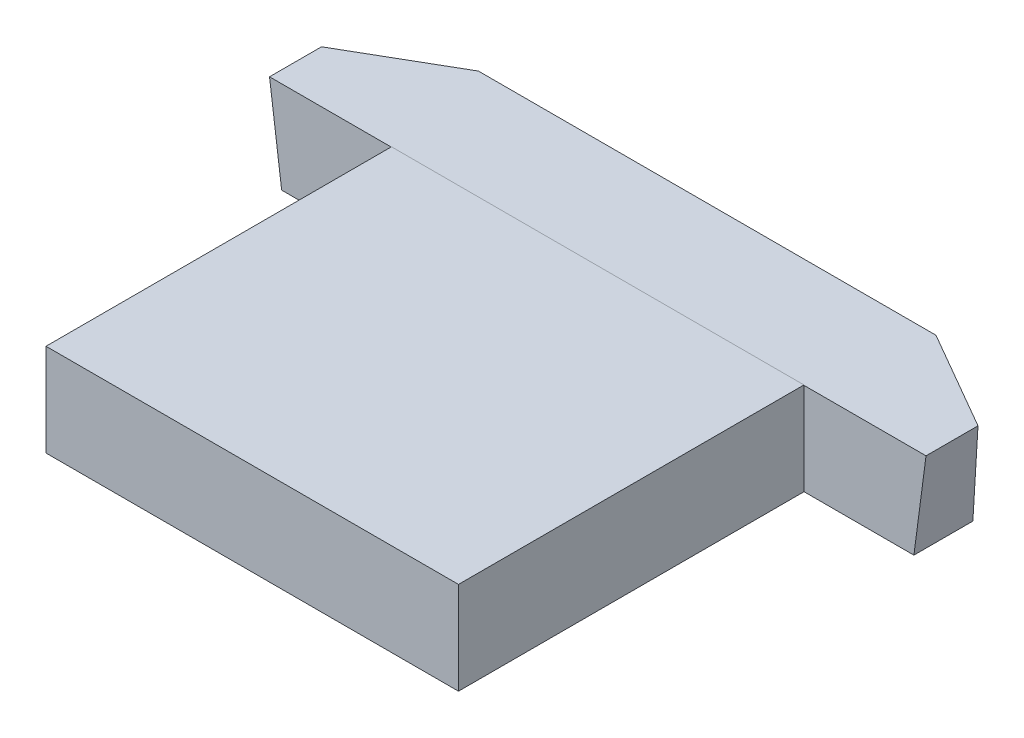
ISO-10303-21;
HEADER;
FILE_DESCRIPTION(('STEP AP214'),'2;1');
FILE_NAME('part.step','',(''),(''),'','','');
FILE_SCHEMA(('AUTOMOTIVE_DESIGN { 1 0 10303 214 1 1 1 1 }'));
ENDSEC;
DATA;
#1=APPLICATION_CONTEXT('core data for automotive mechanical design processes');
#2=APPLICATION_PROTOCOL_DEFINITION('international standard','automotive_design',2000,#1);
#3=PRODUCT_CONTEXT('',#1,'mechanical');
#4=PRODUCT('Part','Part','',(#3));
#5=PRODUCT_RELATED_PRODUCT_CATEGORY('part','',(#4));
#6=PRODUCT_DEFINITION_FORMATION('','',#4);
#7=PRODUCT_DEFINITION_CONTEXT('part definition',#1,'design');
#8=PRODUCT_DEFINITION('design','',#6,#7);
#9=PRODUCT_DEFINITION_SHAPE('','',#8);
#10=(LENGTH_UNIT() NAMED_UNIT(*) SI_UNIT(.MILLI.,.METRE.));
#11=(NAMED_UNIT(*) PLANE_ANGLE_UNIT() SI_UNIT($,.RADIAN.));
#12=(NAMED_UNIT(*) SI_UNIT($,.STERADIAN.) SOLID_ANGLE_UNIT());
#13=UNCERTAINTY_MEASURE_WITH_UNIT(LENGTH_MEASURE(1.E-05),#10,'distance_accuracy_value','');
#14=(GEOMETRIC_REPRESENTATION_CONTEXT(3) GLOBAL_UNCERTAINTY_ASSIGNED_CONTEXT((#13)) GLOBAL_UNIT_ASSIGNED_CONTEXT((#10,
#11,#12)) REPRESENTATION_CONTEXT('',''));
#15=CARTESIAN_POINT('',(0.,0.,0.));
#16=DIRECTION('',(0.,0.,1.));
#17=DIRECTION('',(1.,0.,0.));
#18=AXIS2_PLACEMENT_3D('',#15,#16,#17);
#19=CARTESIAN_POINT('',(3.11,-2.3789,0.5725));
#20=DIRECTION('',(1.,0.,0.));
#21=DIRECTION('',(0.,0.,-1.));
#22=AXIS2_PLACEMENT_3D('',#19,#20,#21);
#23=PLANE('',#22);
#24=DIRECTION('',(0.,0.99144486137382,0.130526192219976));
#25=VECTOR('',#24,1.);
#26=CARTESIAN_POINT('',(3.11,-0.84048504976,-4.618151955986));
#27=LINE('',#26,#25);
#28=CARTESIAN_POINT('',(3.11,-0.99,-4.637835972612));
#29=VERTEX_POINT('',#28);
#30=CARTESIAN_POINT('',(3.11,-0.9839,-4.637032892376));
#31=VERTEX_POINT('',#30);
#32=EDGE_CURVE('E11',#29,#31,#27,.T.);
#33=ORIENTED_EDGE('',*,*,#32,.T.);
#34=DIRECTION('',(0.,0.,-1.));
#35=VECTOR('',#34,1.);
#36=CARTESIAN_POINT('',(3.11,-0.9839,-6.2875));
#37=LINE('',#36,#35);
#38=CARTESIAN_POINT('',(3.11,-0.9839,0.5725));
#39=VERTEX_POINT('',#38);
#40=EDGE_CURVE('E41',#39,#31,#37,.T.);
#41=ORIENTED_EDGE('',*,*,#40,.F.);
#42=DIRECTION('',(0.,1.,0.));
#43=VECTOR('',#42,1.);
#44=CARTESIAN_POINT('',(3.11,-2.3789,0.5725));
#45=LINE('',#44,#43);
#46=CARTESIAN_POINT('',(3.11,-2.3789,0.5725));
#47=VERTEX_POINT('',#46);
#48=EDGE_CURVE('E172',#47,#39,#45,.T.);
#49=ORIENTED_EDGE('',*,*,#48,.F.);
#50=DIRECTION('',(0.,0.,-1.));
#51=VECTOR('',#50,1.);
#52=CARTESIAN_POINT('',(3.11,-2.3789,0.408880478544));
#53=LINE('',#52,#51);
#54=CARTESIAN_POINT('',(3.11,-2.3789,-4.637835972612));
#55=VERTEX_POINT('',#54);
#56=EDGE_CURVE('E27',#47,#55,#53,.T.);
#57=ORIENTED_EDGE('',*,*,#56,.T.);
#58=DIRECTION('',(0.,1.,0.));
#59=VECTOR('',#58,1.);
#60=CARTESIAN_POINT('',(3.11,-2.3789,-4.637835972612));
#61=LINE('',#60,#59);
#62=EDGE_CURVE('E245',#55,#29,#61,.T.);
#63=ORIENTED_EDGE('',*,*,#62,.T.);
#64=EDGE_LOOP('',(#33,#41,#49,#57,#63));
#65=FACE_BOUND('',#64,.T.);
#66=ADVANCED_FACE('F17',(#65),#23,.T.);
#67=CARTESIAN_POINT('',(1.779166753583,-0.9839,-6.562863377694));
#68=DIRECTION('',(0.,1.,0.));
#69=DIRECTION('',(1.,0.,0.));
#70=AXIS2_PLACEMENT_3D('',#67,#68,#69);
#71=PLANE('',#70);
#72=DIRECTION('',(-1.,0.,0.));
#73=VECTOR('',#72,1.);
#74=CARTESIAN_POINT('',(-1.650416623208,-0.9839,-4.637032892376));
#75=LINE('',#74,#73);
#76=CARTESIAN_POINT('',(-3.11,-0.9839,-4.637032892376));
#77=VERTEX_POINT('',#76);
#78=EDGE_CURVE('E248',#31,#77,#75,.T.);
#79=ORIENTED_EDGE('',*,*,#78,.T.);
#80=DIRECTION('',(0.,0.,1.));
#81=VECTOR('',#80,1.);
#82=CARTESIAN_POINT('',(-3.11,-0.9839,0.5725));
#83=LINE('',#82,#81);
#84=CARTESIAN_POINT('',(-3.11,-0.9839,0.5725));
#85=VERTEX_POINT('',#84);
#86=EDGE_CURVE('E20',#77,#85,#83,.T.);
#87=ORIENTED_EDGE('',*,*,#86,.T.);
#88=DIRECTION('',(1.,0.,0.));
#89=VECTOR('',#88,1.);
#90=CARTESIAN_POINT('',(3.11,-0.9839,0.5725));
#91=LINE('',#90,#89);
#92=EDGE_CURVE('E260',#85,#39,#91,.T.);
#93=ORIENTED_EDGE('',*,*,#92,.T.);
#94=ORIENTED_EDGE('',*,*,#40,.T.);
#95=EDGE_LOOP('',(#79,#87,#93,#94));
#96=FACE_BOUND('',#95,.T.);
#97=ADVANCED_FACE('F300',(#96),#71,.T.);
#98=CARTESIAN_POINT('',(-3.11,-2.3789,-6.2875));
#99=DIRECTION('',(-1.,0.,0.));
#100=DIRECTION('',(0.,1.,0.));
#101=AXIS2_PLACEMENT_3D('',#98,#99,#100);
#102=PLANE('',#101);
#103=DIRECTION('',(0.,-0.99144486137382,-0.130526192219976));
#104=VECTOR('',#103,1.);
#105=CARTESIAN_POINT('',(-3.11,-1.28435971211,-4.6765891639));
#106=LINE('',#105,#104);
#107=CARTESIAN_POINT('',(-3.11,-0.99,-4.637835972612));
#108=VERTEX_POINT('',#107);
#109=EDGE_CURVE('E196',#77,#108,#106,.T.);
#110=ORIENTED_EDGE('',*,*,#109,.T.);
#111=DIRECTION('',(0.,-1.,0.));
#112=VECTOR('',#111,1.);
#113=CARTESIAN_POINT('',(-3.11,-2.3789,-4.637835972612));
#114=LINE('',#113,#112);
#115=CARTESIAN_POINT('',(-3.11,-2.3789,-4.637835972612));
#116=VERTEX_POINT('',#115);
#117=EDGE_CURVE('E192',#108,#116,#114,.T.);
#118=ORIENTED_EDGE('',*,*,#117,.T.);
#119=DIRECTION('',(0.,0.,1.));
#120=VECTOR('',#119,1.);
#121=CARTESIAN_POINT('',(-3.11,-2.3789,-3.021119521456));
#122=LINE('',#121,#120);
#123=CARTESIAN_POINT('',(-3.11,-2.3789,0.5725));
#124=VERTEX_POINT('',#123);
#125=EDGE_CURVE('E197',#116,#124,#122,.T.);
#126=ORIENTED_EDGE('',*,*,#125,.T.);
#127=DIRECTION('',(0.,1.,0.));
#128=VECTOR('',#127,1.);
#129=CARTESIAN_POINT('',(-3.11,-2.3789,0.5725));
#130=LINE('',#129,#128);
#131=EDGE_CURVE('E201',#124,#85,#130,.T.);
#132=ORIENTED_EDGE('',*,*,#131,.T.);
#133=ORIENTED_EDGE('',*,*,#86,.F.);
#134=EDGE_LOOP('',(#110,#118,#126,#132,#133));
#135=FACE_BOUND('',#134,.T.);
#136=ADVANCED_FACE('F278',(#135),#102,.T.);
#137=CARTESIAN_POINT('',(-4.949664027388,-2.3789,-4.637835972612));
#138=DIRECTION('',(0.,0.,1.));
#139=DIRECTION('',(1.,0.,0.));
#140=AXIS2_PLACEMENT_3D('',#137,#138,#139);
#141=PLANE('',#140);
#142=DIRECTION('',(-1.,0.,0.));
#143=VECTOR('',#142,1.);
#144=CARTESIAN_POINT('',(7.837924348314,-0.99,-4.637835972612));
#145=LINE('',#144,#143);
#146=CARTESIAN_POINT('',(-4.949664027388,-0.99,-4.637835972612));
#147=VERTEX_POINT('',#146);
#148=EDGE_CURVE('E198',#108,#147,#145,.T.);
#149=ORIENTED_EDGE('',*,*,#148,.T.);
#150=DIRECTION('',(0.130526192219976,-0.99144486137382,0.));
#151=VECTOR('',#150,1.);
#152=CARTESIAN_POINT('',(-4.924963570759,-1.177618595033,-4.637835972612));
#153=LINE('',#152,#151);
#154=CARTESIAN_POINT('',(-4.766811873489,-2.3789,-4.637835972612));
#155=VERTEX_POINT('',#154);
#156=EDGE_CURVE('E202',#147,#155,#153,.T.);
#157=ORIENTED_EDGE('',*,*,#156,.T.);
#158=DIRECTION('',(1.,0.,0.));
#159=VECTOR('',#158,1.);
#160=CARTESIAN_POINT('',(-2.000660842792,-2.3789,-4.637835972612));
#161=LINE('',#160,#159);
#162=EDGE_CURVE('E116',#155,#116,#161,.T.);
#163=ORIENTED_EDGE('',*,*,#162,.T.);
#164=ORIENTED_EDGE('',*,*,#117,.F.);
#165=EDGE_LOOP('',(#149,#157,#163,#164));
#166=FACE_BOUND('',#165,.T.);
#167=ADVANCED_FACE('F280',(#166),#141,.T.);
#168=CARTESIAN_POINT('',(-4.949664027388,-2.3789,-4.637835972612));
#169=DIRECTION('',(0.,0.,1.));
#170=DIRECTION('',(1.,0.,0.));
#171=AXIS2_PLACEMENT_3D('',#168,#169,#170);
#172=PLANE('',#171);
#173=DIRECTION('',(-1.,0.,0.));
#174=VECTOR('',#173,1.);
#175=CARTESIAN_POINT('',(7.837924348314,-0.99,-4.637835972612));
#176=LINE('',#175,#174);
#177=CARTESIAN_POINT('',(4.949664027388,-0.99,-4.637835972612));
#178=VERTEX_POINT('',#177);
#179=EDGE_CURVE('E212',#178,#29,#176,.T.);
#180=ORIENTED_EDGE('',*,*,#179,.T.);
#181=ORIENTED_EDGE('',*,*,#62,.F.);
#182=DIRECTION('',(1.,0.,0.));
#183=VECTOR('',#182,1.);
#184=CARTESIAN_POINT('',(-2.000660842792,-2.3789,-4.637835972612));
#185=LINE('',#184,#183);
#186=CARTESIAN_POINT('',(4.766811873489,-2.3789,-4.637835972612));
#187=VERTEX_POINT('',#186);
#188=EDGE_CURVE('E187',#55,#187,#185,.T.);
#189=ORIENTED_EDGE('',*,*,#188,.T.);
#190=DIRECTION('',(0.130526192219976,0.99144486137382,0.));
#191=VECTOR('',#190,1.);
#192=CARTESIAN_POINT('',(4.840635714819,-1.818152253607,-4.637835972612));
#193=LINE('',#192,#191);
#194=EDGE_CURVE('E104',#187,#178,#193,.T.);
#195=ORIENTED_EDGE('',*,*,#194,.T.);
#196=EDGE_LOOP('',(#180,#181,#189,#195));
#197=FACE_BOUND('',#196,.T.);
#198=ADVANCED_FACE('F310',(#197),#172,.T.);
#199=CARTESIAN_POINT('',(-3.11,-2.3789,0.5725));
#200=DIRECTION('',(0.,0.,1.));
#201=DIRECTION('',(1.,0.,0.));
#202=AXIS2_PLACEMENT_3D('',#199,#200,#201);
#203=PLANE('',#202);
#204=DIRECTION('',(1.,0.,0.));
#205=VECTOR('',#204,1.);
#206=CARTESIAN_POINT('',(-1.080828829097,-2.3789,0.5725));
#207=LINE('',#206,#205);
#208=EDGE_CURVE('E180',#124,#47,#207,.T.);
#209=ORIENTED_EDGE('',*,*,#208,.T.);
#210=ORIENTED_EDGE('',*,*,#48,.T.);
#211=ORIENTED_EDGE('',*,*,#92,.F.);
#212=ORIENTED_EDGE('',*,*,#131,.F.);
#213=EDGE_LOOP('',(#209,#210,#211,#212));
#214=FACE_BOUND('',#213,.T.);
#215=ADVANCED_FACE('F274',(#214),#203,.T.);
#216=CARTESIAN_POINT('',(5.08,0.,-4.5075));
#217=DIRECTION('',(0.99144486137382,-0.130526192219976,0.));
#218=DIRECTION('',(0.,0.,-1.));
#219=AXIS2_PLACEMENT_3D('',#216,#217,#218);
#220=PLANE('',#219);
#221=ORIENTED_EDGE('',*,*,#194,.F.);
#222=DIRECTION('',(0.,0.,-1.));
#223=VECTOR('',#222,1.);
#224=CARTESIAN_POINT('',(4.766811873489,-2.3789,-2.131119521456));
#225=LINE('',#224,#223);
#226=CARTESIAN_POINT('',(4.766811873489,-2.3789,-5.527044336491));
#227=VERTEX_POINT('',#226);
#228=EDGE_CURVE('E170',#187,#227,#225,.T.);
#229=ORIENTED_EDGE('',*,*,#228,.T.);
#230=DIRECTION('',(0.130157132392036,0.988641573667275,0.0751462554235109));
#231=VECTOR('',#230,1.);
#232=CARTESIAN_POINT('',(4.770028489328,-2.354467377012,-5.525187222471));
#233=LINE('',#232,#231);
#234=CARTESIAN_POINT('',(4.949664027388,-0.99,-5.421474596216));
#235=VERTEX_POINT('',#234);
#236=EDGE_CURVE('E173',#227,#235,#233,.T.);
#237=ORIENTED_EDGE('',*,*,#236,.T.);
#238=DIRECTION('',(0.,0.,1.));
#239=VECTOR('',#238,1.);
#240=CARTESIAN_POINT('',(4.949664027388,-0.99,-4.637835972612));
#241=LINE('',#240,#239);
#242=EDGE_CURVE('E125',#235,#178,#241,.T.);
#243=ORIENTED_EDGE('',*,*,#242,.T.);
#244=EDGE_LOOP('',(#221,#229,#237,#243));
#245=FACE_BOUND('',#244,.T.);
#246=ADVANCED_FACE('F229',(#245),#220,.T.);
#247=CARTESIAN_POINT('',(0.948342341805,-2.3789,0.245260957088));
#248=DIRECTION('',(0.,1.,0.));
#249=DIRECTION('',(1.,0.,0.));
#250=AXIS2_PLACEMENT_3D('',#247,#248,#249);
#251=PLANE('',#250);
#252=ORIENTED_EDGE('',*,*,#188,.F.);
#253=ORIENTED_EDGE('',*,*,#56,.F.);
#254=ORIENTED_EDGE('',*,*,#208,.F.);
#255=ORIENTED_EDGE('',*,*,#125,.F.);
#256=ORIENTED_EDGE('',*,*,#162,.F.);
#257=DIRECTION('',(0.,0.,1.));
#258=VECTOR('',#257,1.);
#259=CARTESIAN_POINT('',(-4.766811873489,-2.3789,-2.131119521456));
#260=LINE('',#259,#258);
#261=CARTESIAN_POINT('',(-4.766811873489,-2.3789,-5.527044336491));
#262=VERTEX_POINT('',#261);
#263=EDGE_CURVE('E148',#262,#155,#260,.T.);
#264=ORIENTED_EDGE('',*,*,#263,.F.);
#265=DIRECTION('',(-0.866025403784329,0.,0.50000000000019));
#266=VECTOR('',#265,1.);
#267=CARTESIAN_POINT('',(-3.964795875363,-2.3789,-5.990088488904));
#268=LINE('',#267,#266);
#269=CARTESIAN_POINT('',(-3.449664027388,-2.3789,-6.2875));
#270=VERTEX_POINT('',#269);
#271=EDGE_CURVE('E134',#270,#262,#268,.T.);
#272=ORIENTED_EDGE('',*,*,#271,.F.);
#273=DIRECTION('',(-1.,0.,0.));
#274=VECTOR('',#273,1.);
#275=CARTESIAN_POINT('',(4.39313334506,-2.3789,-6.2875));
#276=LINE('',#275,#274);
#277=CARTESIAN_POINT('',(3.449664027388,-2.3789,-6.2875));
#278=VERTEX_POINT('',#277);
#279=EDGE_CURVE('E191',#278,#270,#276,.T.);
#280=ORIENTED_EDGE('',*,*,#279,.F.);
#281=DIRECTION('',(-0.866025403784329,0.,-0.50000000000019));
#282=VECTOR('',#281,1.);
#283=CARTESIAN_POINT('',(4.676052631717,-2.3789,-5.57944420916));
#284=LINE('',#283,#282);
#285=EDGE_CURVE('E177',#227,#278,#284,.T.);
#286=ORIENTED_EDGE('',*,*,#285,.F.);
#287=ORIENTED_EDGE('',*,*,#228,.F.);
#288=EDGE_LOOP('',(#252,#253,#254,#255,#256,#264,#272,#280,#286,#287));
#289=FACE_BOUND('',#288,.T.);
#290=ADVANCED_FACE('F150',(#289),#251,.F.);
#291=CARTESIAN_POINT('',(4.949664027388,-2.386,-5.421474596216));
#292=DIRECTION('',(-0.50000000000019,0.,0.866025403784329));
#293=DIRECTION('',(0.,1.,0.));
#294=AXIS2_PLACEMENT_3D('',#291,#292,#293);
#295=PLANE('',#294);
#296=ORIENTED_EDGE('',*,*,#285,.T.);
#297=DIRECTION('',(0.,1.,0.));
#298=VECTOR('',#297,1.);
#299=CARTESIAN_POINT('',(3.449664027388,-2.386,-6.2875));
#300=LINE('',#299,#298);
#301=CARTESIAN_POINT('',(3.449664027388,-0.99,-6.2875));
#302=VERTEX_POINT('',#301);
#303=EDGE_CURVE('E165',#278,#302,#300,.T.);
#304=ORIENTED_EDGE('',*,*,#303,.T.);
#305=DIRECTION('',(0.866025403784329,0.,0.50000000000019));
#306=VECTOR('',#305,1.);
#307=CARTESIAN_POINT('',(4.949664027388,-0.99,-5.421474596216));
#308=LINE('',#307,#306);
#309=EDGE_CURVE('E158',#302,#235,#308,.T.);
#310=ORIENTED_EDGE('',*,*,#309,.T.);
#311=ORIENTED_EDGE('',*,*,#236,.F.);
#312=EDGE_LOOP('',(#296,#304,#310,#311));
#313=FACE_BOUND('',#312,.T.);
#314=ADVANCED_FACE('F228',(#313),#295,.F.);
#315=CARTESIAN_POINT('',(-5.08,0.,-4.5075));
#316=DIRECTION('',(-0.99144486137382,-0.130526192219976,0.));
#317=DIRECTION('',(-0.130526192219976,0.99144486137382,0.));
#318=AXIS2_PLACEMENT_3D('',#315,#316,#317);
#319=PLANE('',#318);
#320=ORIENTED_EDGE('',*,*,#156,.F.);
#321=DIRECTION('',(0.,0.,1.));
#322=VECTOR('',#321,1.);
#323=CARTESIAN_POINT('',(-4.949664027388,-0.99,-4.637835972612));
#324=LINE('',#323,#322);
#325=CARTESIAN_POINT('',(-4.949664027388,-0.99,-5.421474596216));
#326=VERTEX_POINT('',#325);
#327=EDGE_CURVE('E144',#326,#147,#324,.T.);
#328=ORIENTED_EDGE('',*,*,#327,.F.);
#329=DIRECTION('',(0.130157132392036,-0.988641573667275,-0.0751462554235109));
#330=VECTOR('',#329,1.);
#331=CARTESIAN_POINT('',(-4.770028489328,-2.354467377012,-5.525187222471));
#332=LINE('',#331,#330);
#333=EDGE_CURVE('E138',#326,#262,#332,.T.);
#334=ORIENTED_EDGE('',*,*,#333,.T.);
#335=ORIENTED_EDGE('',*,*,#263,.T.);
#336=EDGE_LOOP('',(#320,#328,#334,#335));
#337=FACE_BOUND('',#336,.T.);
#338=ADVANCED_FACE('F155',(#337),#319,.T.);
#339=CARTESIAN_POINT('',(-5.08,0.,-4.5075));
#340=DIRECTION('',(0.,0.130526192219976,-0.99144486137382));
#341=DIRECTION('',(-1.,0.,0.));
#342=AXIS2_PLACEMENT_3D('',#339,#340,#341);
#343=PLANE('',#342);
#344=ORIENTED_EDGE('',*,*,#32,.F.);
#345=DIRECTION('',(-1.,0.,0.));
#346=VECTOR('',#345,1.);
#347=CARTESIAN_POINT('',(7.837924348314,-0.99,-4.637835972612));
#348=LINE('',#347,#346);
#349=EDGE_CURVE('E153',#29,#108,#348,.T.);
#350=ORIENTED_EDGE('',*,*,#349,.T.);
#351=ORIENTED_EDGE('',*,*,#109,.F.);
#352=ORIENTED_EDGE('',*,*,#78,.F.);
#353=EDGE_LOOP('',(#344,#350,#351,#352));
#354=FACE_BOUND('',#353,.T.);
#355=ADVANCED_FACE('F296',(#354),#343,.T.);
#356=CARTESIAN_POINT('',(7.837924348314,-2.385,-6.2875));
#357=DIRECTION('',(0.,0.,1.));
#358=DIRECTION('',(1.,0.,0.));
#359=AXIS2_PLACEMENT_3D('',#356,#357,#358);
#360=PLANE('',#359);
#361=ORIENTED_EDGE('',*,*,#279,.T.);
#362=DIRECTION('',(0.,1.,0.));
#363=VECTOR('',#362,1.);
#364=CARTESIAN_POINT('',(-3.449664027388,-2.386,-6.2875));
#365=LINE('',#364,#363);
#366=CARTESIAN_POINT('',(-3.449664027388,-0.99,-6.2875));
#367=VERTEX_POINT('',#366);
#368=EDGE_CURVE('E141',#270,#367,#365,.T.);
#369=ORIENTED_EDGE('',*,*,#368,.T.);
#370=DIRECTION('',(-1.,0.,0.));
#371=VECTOR('',#370,1.);
#372=CARTESIAN_POINT('',(7.837924348314,-0.99,-6.2875));
#373=LINE('',#372,#371);
#374=EDGE_CURVE('E206',#302,#367,#373,.T.);
#375=ORIENTED_EDGE('',*,*,#374,.F.);
#376=ORIENTED_EDGE('',*,*,#303,.F.);
#377=EDGE_LOOP('',(#361,#369,#375,#376));
#378=FACE_BOUND('',#377,.T.);
#379=ADVANCED_FACE('F223',(#378),#360,.F.);
#380=CARTESIAN_POINT('',(7.837924348314,-0.99,-4.637835972612));
#381=DIRECTION('',(0.,-1.,0.));
#382=DIRECTION('',(0.,0.,-1.));
#383=AXIS2_PLACEMENT_3D('',#380,#381,#382);
#384=PLANE('',#383);
#385=ORIENTED_EDGE('',*,*,#374,.T.);
#386=DIRECTION('',(0.866025403784329,0.,-0.50000000000019));
#387=VECTOR('',#386,1.);
#388=CARTESIAN_POINT('',(-4.949664027388,-0.99,-5.421474596216));
#389=LINE('',#388,#387);
#390=EDGE_CURVE('E145',#326,#367,#389,.T.);
#391=ORIENTED_EDGE('',*,*,#390,.F.);
#392=ORIENTED_EDGE('',*,*,#327,.T.);
#393=ORIENTED_EDGE('',*,*,#148,.F.);
#394=ORIENTED_EDGE('',*,*,#349,.F.);
#395=ORIENTED_EDGE('',*,*,#179,.F.);
#396=ORIENTED_EDGE('',*,*,#242,.F.);
#397=ORIENTED_EDGE('',*,*,#309,.F.);
#398=EDGE_LOOP('',(#385,#391,#392,#393,#394,#395,#396,#397));
#399=FACE_BOUND('',#398,.T.);
#400=ADVANCED_FACE('F287',(#399),#384,.F.);
#401=CARTESIAN_POINT('',(-4.949664027388,-2.386,-5.421474596216));
#402=DIRECTION('',(0.50000000000019,0.,0.866025403784329));
#403=DIRECTION('',(0.,-1.,0.));
#404=AXIS2_PLACEMENT_3D('',#401,#402,#403);
#405=PLANE('',#404);
#406=ORIENTED_EDGE('',*,*,#271,.T.);
#407=ORIENTED_EDGE('',*,*,#333,.F.);
#408=ORIENTED_EDGE('',*,*,#390,.T.);
#409=ORIENTED_EDGE('',*,*,#368,.F.);
#410=EDGE_LOOP('',(#406,#407,#408,#409));
#411=FACE_BOUND('',#410,.T.);
#412=ADVANCED_FACE('F135',(#411),#405,.F.);
#413=CLOSED_SHELL('',(#66,#97,#136,#167,#198,#215,#246,#290,#314,#338,#355,#379,#400,#412));
#414=MANIFOLD_SOLID_BREP('B1',#413);
#415=ADVANCED_BREP_SHAPE_REPRESENTATION('',(#18,#414),#14);
#416=SHAPE_DEFINITION_REPRESENTATION(#9,#415);
ENDSEC;
END-ISO-10303-21;
